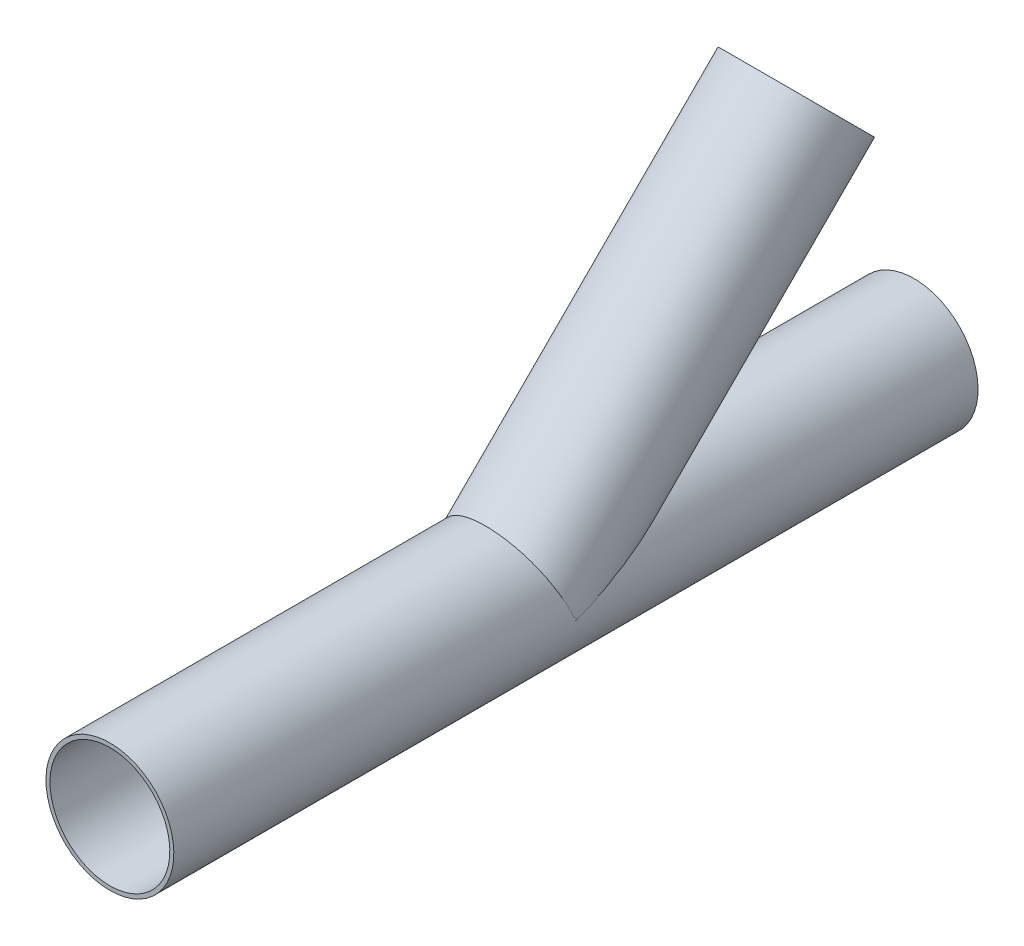
ISO-10303-21;
HEADER;
FILE_DESCRIPTION(('STEP AP214'),'2;1');
FILE_NAME('part.step','',(''),(''),'','','');
FILE_SCHEMA(('AUTOMOTIVE_DESIGN { 1 0 10303 214 1 1 1 1 }'));
ENDSEC;
DATA;
#1=APPLICATION_CONTEXT('core data for automotive mechanical design processes');
#2=APPLICATION_PROTOCOL_DEFINITION('international standard','automotive_design',2000,#1);
#3=PRODUCT_CONTEXT('',#1,'mechanical');
#4=PRODUCT('Part','Part','',(#3));
#5=PRODUCT_RELATED_PRODUCT_CATEGORY('part','',(#4));
#6=PRODUCT_DEFINITION_FORMATION('','',#4);
#7=PRODUCT_DEFINITION_CONTEXT('part definition',#1,'design');
#8=PRODUCT_DEFINITION('design','',#6,#7);
#9=PRODUCT_DEFINITION_SHAPE('','',#8);
#10=(LENGTH_UNIT() NAMED_UNIT(*) SI_UNIT(.MILLI.,.METRE.));
#11=(NAMED_UNIT(*) PLANE_ANGLE_UNIT() SI_UNIT($,.RADIAN.));
#12=(NAMED_UNIT(*) SI_UNIT($,.STERADIAN.) SOLID_ANGLE_UNIT());
#13=UNCERTAINTY_MEASURE_WITH_UNIT(LENGTH_MEASURE(1.E-05),#10,'distance_accuracy_value','');
#14=(GEOMETRIC_REPRESENTATION_CONTEXT(3) GLOBAL_UNCERTAINTY_ASSIGNED_CONTEXT((#13)) GLOBAL_UNIT_ASSIGNED_CONTEXT((#10,
#11,#12)) REPRESENTATION_CONTEXT('',''));
#15=CARTESIAN_POINT('',(0.,0.,0.));
#16=DIRECTION('',(0.,0.,1.));
#17=DIRECTION('',(1.,0.,0.));
#18=AXIS2_PLACEMENT_3D('',#15,#16,#17);
#19=CARTESIAN_POINT('',(0.,353.553390593272,-353.553390593275));
#20=DIRECTION('',(0.,-0.707106781186544,0.707106781186551));
#21=DIRECTION('',(0.,-0.707106781186551,-0.707106781186544));
#22=AXIS2_PLACEMENT_3D('',#19,#20,#21);
#23=CYLINDRICAL_SURFACE('',#22,74.5);
#24=CARTESIAN_POINT('',(0.,353.553390593272,-353.553390593275));
#25=DIRECTION('',(0.,0.707106781186544,-0.707106781186551));
#26=DIRECTION('',(0.,0.707106781186551,0.707106781186544));
#27=AXIS2_PLACEMENT_3D('',#24,#25,#26);
#28=CIRCLE('',#27,74.5);
#29=CARTESIAN_POINT('',(0.,406.23284579167,-300.873935394878));
#30=VERTEX_POINT('',#29);
#31=EDGE_CURVE('E91',#30,#30,#28,.T.);
#32=ORIENTED_EDGE('',*,*,#31,.T.);
#33=EDGE_LOOP('',(#32));
#34=FACE_BOUND('',#33,.T.);
#35=CARTESIAN_POINT('',(0.,79.5000000000003,-184.858910396797));
#36=CARTESIAN_POINT('',(0.916473345615551,79.4999968370298,-184.858902519054));
#37=CARTESIAN_POINT('',(1.83301175927182,79.484108227431,-184.819036929391));
#38=CARTESIAN_POINT('',(3.6581791572464,79.4210421686026,-184.660788213563));
#39=CARTESIAN_POINT('',(4.56680748053886,79.3738621293813,-184.542398587963));
#40=CARTESIAN_POINT('',(6.36982747706487,79.2495599012649,-184.230446552565));
#41=CARTESIAN_POINT('',(7.26420427308407,79.1724083162759,-184.036810340853));
#42=CARTESIAN_POINT('',(9.03191516690699,78.9902816308743,-183.579628636092));
#43=CARTESIAN_POINT('',(9.90524699942825,78.8853035496793,-183.316075653536));
#44=CARTESIAN_POINT('',(11.8384831968399,78.6210636807757,-182.652546361617));
#45=CARTESIAN_POINT('',(12.891403445037,78.4548006270642,-182.234958245629));
#46=CARTESIAN_POINT('',(14.9524725729772,78.088224031074,-181.313953136172));
#47=CARTESIAN_POINT('',(15.9606086282144,77.8879008135206,-180.810511754738));
#48=CARTESIAN_POINT('',(18.9176477354788,77.2427809220914,-179.1885914392));
#49=CARTESIAN_POINT('',(20.7971626709418,76.7541273841853,-177.9592524275));
#50=CARTESIAN_POINT('',(23.3264373706989,76.0047958050352,-176.072137782285));
#51=CARTESIAN_POINT('',(24.0537166969221,75.7775096170781,-175.499518118673));
#52=CARTESIAN_POINT('',(25.4780752621681,75.3105494264291,-174.322541969162));
#53=CARTESIAN_POINT('',(26.1751608001273,75.0708780306045,-173.718192161473));
#54=CARTESIAN_POINT('',(27.5408624989332,74.5806800685627,-172.48152208028));
#55=CARTESIAN_POINT('',(28.2094577870256,74.3301458060782,-171.849181968984));
#56=CARTESIAN_POINT('',(29.5192538413295,73.8197642638601,-170.5603268534));
#57=CARTESIAN_POINT('',(30.1604535247432,73.5599166167647,-169.903810895479));
#58=CARTESIAN_POINT('',(31.4182765279049,73.0315565574644,-168.568145952586));
#59=CARTESIAN_POINT('',(32.0348431033674,72.763026457802,-167.888950660573));
#60=CARTESIAN_POINT('',(33.2433689955826,72.2188862940032,-166.511836679653));
#61=CARTESIAN_POINT('',(33.8353289496613,71.9432764135369,-165.813918476453));
#62=CARTESIAN_POINT('',(34.9959017706084,71.3859309297682,-164.401680440194));
#63=CARTESIAN_POINT('',(35.5645206438356,71.104196931291,-163.687364901372));
#64=CARTESIAN_POINT('',(36.6799029162562,70.5352864921914,-162.243970021145));
#65=CARTESIAN_POINT('',(37.2266654657067,70.2481098406051,-161.514890107379));
#66=CARTESIAN_POINT('',(38.3315391469445,69.651708045372,-159.999679934412));
#67=CARTESIAN_POINT('',(38.8883817689266,69.3421895199246,-159.212740780314));
#68=CARTESIAN_POINT('',(39.9802269241163,68.7184586127194,-157.625660793891));
#69=CARTESIAN_POINT('',(40.5152283544662,68.4042459950277,-156.825519297778));
#70=CARTESIAN_POINT('',(42.0895114226032,67.4553654322435,-154.407145713899));
#71=CARTESIAN_POINT('',(43.0979313774252,66.8145312429495,-152.771158740407));
#72=CARTESIAN_POINT('',(45.0418629998623,65.5198053704473,-149.45947946336));
#73=CARTESIAN_POINT('',(45.9773053044045,64.8659019892219,-147.783751312595));
#74=CARTESIAN_POINT('',(47.7814768723458,63.5486250893652,-144.400679990209));
#75=CARTESIAN_POINT('',(48.6502111205881,62.8852522827503,-142.693339192738));
#76=CARTESIAN_POINT('',(50.3284412809849,61.5503791534484,-139.249284921677));
#77=CARTESIAN_POINT('',(51.1378418399058,60.8788676854565,-137.512529460947));
#78=CARTESIAN_POINT('',(52.7010638634016,59.5307733835317,-134.016148544851));
#79=CARTESIAN_POINT('',(53.454884376471,58.8541904629959,-132.256522698559));
#80=CARTESIAN_POINT('',(54.9109284121713,57.4980790422889,-128.718363426976));
#81=CARTESIAN_POINT('',(55.6131771218546,56.8185521539693,-126.939839723583));
#82=CARTESIAN_POINT('',(56.9701773553412,55.4578402652709,-123.365450356024));
#83=CARTESIAN_POINT('',(57.6249294244348,54.7766552840209,-121.569584891218));
#84=CARTESIAN_POINT('',(58.8168675433299,53.493005947647,-118.17115126365));
#85=CARTESIAN_POINT('',(59.3588896395046,52.8905558005945,-116.570268821047));
#86=CARTESIAN_POINT('',(60.4101338150079,51.686597635299,-113.357441221129));
#87=CARTESIAN_POINT('',(60.9193561199802,51.0850896106025,-111.745496140004));
#88=CARTESIAN_POINT('',(61.9066708230491,49.8840497615943,-108.511254537522));
#89=CARTESIAN_POINT('',(62.384761236652,49.2845180655711,-106.888957363498));
#90=CARTESIAN_POINT('',(63.3111975777639,48.088609324528,-103.634741724007));
#91=CARTESIAN_POINT('',(63.7595434753754,47.4922322826796,-102.002823248871));
#92=CARTESIAN_POINT('',(64.6268202836151,46.305110980375,-98.7332090267022));
#93=CARTESIAN_POINT('',(65.0458100409376,45.7143576294031,-97.0955321761403));
#94=CARTESIAN_POINT('',(65.8564320911169,44.5386368073682,-93.8113544337773));
#95=CARTESIAN_POINT('',(66.2480643329054,43.9536693471075,-92.1648535255106));
#96=CARTESIAN_POINT('',(67.0048171862133,42.7911839115067,-88.8632916448135));
#97=CARTESIAN_POINT('',(67.369939657569,42.2136654159146,-87.2082312816297));
#98=CARTESIAN_POINT('',(68.0744091706656,41.0679554287769,-83.8894287643955));
#99=CARTESIAN_POINT('',(68.4137564230997,40.4997638610205,-82.2256866814306));
#100=CARTESIAN_POINT('',(68.9807000818772,39.5239385298475,-79.3310001988316));
#101=CARTESIAN_POINT('',(69.2140963358435,39.1136240621505,-78.1020916615078));
#102=CARTESIAN_POINT('',(69.6673830883059,38.3004229381638,-75.6393380132235));
#103=CARTESIAN_POINT('',(69.8872736526382,37.8975362456725,-74.4054929263586));
#104=CARTESIAN_POINT('',(70.3136461922664,37.1004775589759,-71.9325807976368));
#105=CARTESIAN_POINT('',(70.5201272250757,36.7063061786063,-70.6935133952342));
#106=CARTESIAN_POINT('',(70.9196699106571,35.9282846594408,-68.2099809527997));
#107=CARTESIAN_POINT('',(71.1127315648244,35.544434519572,-66.965515913329));
#108=CARTESIAN_POINT('',(71.4857302656156,34.7881943538361,-64.4683189295519));
#109=CARTESIAN_POINT('',(71.6656397989549,34.4158292437755,-63.2155753145079));
#110=CARTESIAN_POINT('',(72.0117026027396,33.685721989621,-60.7039171276745));
#111=CARTESIAN_POINT('',(72.1778557510185,33.3279799754047,-59.4450025011873));
#112=CARTESIAN_POINT('',(72.4960292674801,32.6300899907729,-56.9207453256656));
#113=CARTESIAN_POINT('',(72.6480520118065,32.2899390665542,-55.6554038952302));
#114=CARTESIAN_POINT('',(72.9374529535795,31.6307989147984,-53.1175524043385));
#115=CARTESIAN_POINT('',(73.0748315193072,31.3118091551633,-51.8450425250068));
#116=CARTESIAN_POINT('',(73.2982434536206,30.7843366799546,-49.6455301353555));
#117=CARTESIAN_POINT('',(73.3879642619443,30.5697039272105,-48.7203771298108));
#118=CARTESIAN_POINT('',(73.5588868787169,30.1560973427165,-46.8658010703255));
#119=CARTESIAN_POINT('',(73.6400889063562,29.9571231081018,-45.9363781268941));
#120=CARTESIAN_POINT('',(73.793456873759,29.5773171657123,-44.0726278955217));
#121=CARTESIAN_POINT('',(73.8656186920456,29.3964937403951,-43.1382985715272));
#122=CARTESIAN_POINT('',(74.0001385816271,29.056203596079,-41.2650375199981));
#123=CARTESIAN_POINT('',(74.062496756649,28.8967366511219,-40.3261058412669));
#124=CARTESIAN_POINT('',(74.1763465053455,28.6032229000745,-38.4456824806192));
#125=CARTESIAN_POINT('',(74.2278614314953,28.469121530132,-37.5042008163526));
#126=CARTESIAN_POINT('',(74.3189891411705,28.230377453552,-35.6168197156953));
#127=CARTESIAN_POINT('',(74.3586011664932,28.1257366235477,-34.6709200017752));
#128=CARTESIAN_POINT('',(74.4243341776404,27.9513366799721,-32.7761269618144));
#129=CARTESIAN_POINT('',(74.4504659203027,27.8815497555107,-31.8272366324679));
#130=CARTESIAN_POINT('',(74.4872966423951,27.7830070367093,-29.9271285076226));
#131=CARTESIAN_POINT('',(74.497998851082,27.7542426567494,-28.9759112408875));
#132=CARTESIAN_POINT('',(74.5015782476623,27.7446406150244,-27.0271114744445));
#133=CARTESIAN_POINT('',(74.4935701216697,27.7661833001223,-26.0295071677794));
#134=CARTESIAN_POINT('',(74.4543659829971,27.871145270073,-24.0378428932668));
#135=CARTESIAN_POINT('',(74.4231710791346,27.9545615960589,-23.0437827582169));
#136=CARTESIAN_POINT('',(74.3336296663677,28.1918027636036,-21.0681111705734));
#137=CARTESIAN_POINT('',(74.2753651150275,28.345415053077,-20.086471265886));
#138=CARTESIAN_POINT('',(74.1273583851348,28.7302510218022,-18.1407647472693));
#139=CARTESIAN_POINT('',(74.0376187720892,28.961468375462,-17.1766967078069));
#140=CARTESIAN_POINT('',(73.8212729817499,29.5085935235217,-15.2646034821244));
#141=CARTESIAN_POINT('',(73.6942482697006,29.8254593598838,-14.316897391888));
#142=CARTESIAN_POINT('',(73.4004106565465,30.5414298710257,-12.4594778381062));
#143=CARTESIAN_POINT('',(73.2335995360759,30.9405308652762,-11.5497626764235));
#144=CARTESIAN_POINT('',(72.857984692864,31.8149391469404,-9.7750660236767));
#145=CARTESIAN_POINT('',(72.6491132672627,32.2903690446832,-8.91015951817086));
#146=CARTESIAN_POINT('',(72.189034974605,33.3062071889046,-7.23116797891092));
#147=CARTESIAN_POINT('',(71.9378194037947,33.8466287877397,-6.4170934408071));
#148=CARTESIAN_POINT('',(71.499248979596,34.7599757300971,-5.14645730828592));
#149=CARTESIAN_POINT('',(71.3248461967015,35.1167033140529,-4.67354875186478));
#150=CARTESIAN_POINT('',(70.960698416389,35.8468351697499,-3.74682393221434));
#151=CARTESIAN_POINT('',(70.7709524057676,36.2202405420933,-3.29300893285811));
#152=CARTESIAN_POINT('',(70.376428066243,36.9809683681144,-2.40387439836362));
#153=CARTESIAN_POINT('',(70.1716472737935,37.3682930972367,-1.96855791285895));
#154=CARTESIAN_POINT('',(69.7473953368052,38.1542963375782,-1.11562299524608));
#155=CARTESIAN_POINT('',(69.5279224356634,38.5529762031431,-0.698006689171979));
#156=CARTESIAN_POINT('',(69.0740047118865,39.3604744481428,0.121556160477907));
#157=CARTESIAN_POINT('',(68.8395192970403,39.7693183147636,0.523455041021443));
#158=CARTESIAN_POINT('',(68.3564590837657,40.5940036436026,1.3113192822459));
#159=CARTESIAN_POINT('',(68.1078829101441,41.009845786026,1.69728308136089));
#160=CARTESIAN_POINT('',(67.3415306082425,42.2649698782195,2.83266511031254));
#161=CARTESIAN_POINT('',(66.8030476974553,43.1119981457914,3.559722711902));
#162=CARTESIAN_POINT('',(65.7875200898424,44.6421084938305,4.81944406755451));
#163=CARTESIAN_POINT('',(65.3200394760644,45.3237428843097,5.36170702778553));
#164=CARTESIAN_POINT('',(64.3524003655674,46.68744309587,6.41591511201127));
#165=CARTESIAN_POINT('',(63.8522381537562,47.3695089572408,6.92785677656773));
#166=CARTESIAN_POINT('',(62.8200105316443,48.7301341913,7.92421401610138));
#167=CARTESIAN_POINT('',(62.287931874906,49.4086919793242,8.40861799724206));
#168=CARTESIAN_POINT('',(61.1929254514179,50.7585575284821,9.35188897288146));
#169=CARTESIAN_POINT('',(60.6299987334208,51.4298655351615,9.81075683447307));
#170=CARTESIAN_POINT('',(59.4741056475795,52.7622844130763,10.7047843260385));
#171=CARTESIAN_POINT('',(58.8811398168486,53.4233954663624,11.1399443796304));
#172=CARTESIAN_POINT('',(57.6659510838676,54.7328600280936,11.9880383465042));
#173=CARTESIAN_POINT('',(57.0437280107665,55.3812134620076,12.4009721299632));
#174=CARTESIAN_POINT('',(55.7709592003699,56.6627348331486,13.2056978045917));
#175=CARTESIAN_POINT('',(55.1204195530413,57.2959059905995,13.5974942015244));
#176=CARTESIAN_POINT('',(53.7916461752311,58.5452004389071,14.3609956048946));
#177=CARTESIAN_POINT('',(53.1134100610595,59.1613222547283,14.7326988755973));
#178=CARTESIAN_POINT('',(51.708486562453,60.3935639530609,15.4680219210998));
#179=CARTESIAN_POINT('',(50.9809472118806,61.0090807926977,15.8310250373875));
#180=CARTESIAN_POINT('',(49.4982453126327,62.2180747763271,16.5370112834976));
#181=CARTESIAN_POINT('',(48.7430803930067,62.8115500197603,16.8799926883787));
#182=CARTESIAN_POINT('',(47.2062133927548,63.9746204486371,17.5463240893095));
#183=CARTESIAN_POINT('',(46.4245122868504,64.5442165094917,17.8696748052155));
#184=CARTESIAN_POINT('',(44.8355352090527,65.6579483383072,18.4970874075362));
#185=CARTESIAN_POINT('',(44.0282570960736,66.2020819652792,18.8011476726902));
#186=CARTESIAN_POINT('',(42.3895519533981,67.2631280303409,19.3900565968539));
#187=CARTESIAN_POINT('',(41.5581323196378,67.7800486716231,19.6749110526934));
#188=CARTESIAN_POINT('',(39.8720195771351,68.7854314544896,20.2256415984648));
#189=CARTESIAN_POINT('',(39.0173245562155,69.2738912474751,20.4915161225729));
#190=CARTESIAN_POINT('',(37.2859929908761,70.2209248974629,21.0042958396415));
#191=CARTESIAN_POINT('',(36.4093569882046,70.6794994913599,21.2512015003538));
#192=CARTESIAN_POINT('',(34.6354380131287,71.5654902383972,21.7260380147533));
#193=CARTESIAN_POINT('',(33.7381549536369,71.9929062600817,21.9539687883873));
#194=CARTESIAN_POINT('',(31.8822435046319,72.8344579954499,22.400936210381));
#195=CARTESIAN_POINT('',(30.9227003093105,73.2470577692294,22.619069715613));
#196=CARTESIAN_POINT('',(28.9841795349201,74.0355472706379,23.0344066151601));
#197=CARTESIAN_POINT('',(28.0052016729077,74.4114364633362,23.2316097044898));
#198=CARTESIAN_POINT('',(26.0295769913539,75.1253238824211,23.6049616152632));
#199=CARTESIAN_POINT('',(25.032930282189,75.4633223454134,23.7811105681781));
#200=CARTESIAN_POINT('',(23.0236967940188,76.1003955888858,24.1122375246112));
#201=CARTESIAN_POINT('',(22.0111085400295,76.3994667436263,24.2672135561227));
#202=CARTESIAN_POINT('',(19.9720569527015,76.9576779064241,24.5558278419001));
#203=CARTESIAN_POINT('',(18.945594625357,77.2168207929209,24.6894676343264));
#204=CARTESIAN_POINT('',(16.8806907528822,77.6943707846956,24.9352900781361));
#205=CARTESIAN_POINT('',(15.8422492004309,77.9127778650769,25.0474727164055));
#206=CARTESIAN_POINT('',(13.7554620608325,78.3081409905576,25.2502540176454));
#207=CARTESIAN_POINT('',(12.7071169284654,78.4850989295009,25.3408536667626));
#208=CARTESIAN_POINT('',(10.6025599837492,78.7970010127619,25.5003702268571));
#209=CARTESIAN_POINT('',(9.5463482002705,78.9319453111905,25.5692872173689));
#210=CARTESIAN_POINT('',(7.47803682066547,79.154021316159,25.682620644166));
#211=CARTESIAN_POINT('',(6.46620203268953,79.2431052418315,25.7280379692138));
#212=CARTESIAN_POINT('',(4.43915256799174,79.3824703792711,25.7990606306788));
#213=CARTESIAN_POINT('',(3.42393761225822,79.4327483038808,25.8246642887312));
#214=CARTESIAN_POINT('',(0.376271203415832,79.5250688755026,25.8716812609059));
#215=CARTESIAN_POINT('',(-1.65881856311954,79.5086645676542,25.8633343069354));
#216=CARTESIAN_POINT('',(-5.71935795424866,79.3200561062789,25.7672641805015));
#217=CARTESIAN_POINT('',(-7.74480859717624,79.1478687951735,25.6795495888407));
#218=CARTESIAN_POINT('',(-11.7717880101405,78.6497942321114,25.4251686861094));
#219=CARTESIAN_POINT('',(-13.7733168408352,78.3239073699718,25.258502575278));
#220=CARTESIAN_POINT('',(-17.7014232220127,77.5296844129392,24.8507279211034));
#221=CARTESIAN_POINT('',(-19.628702167868,77.0640719095027,24.6110414720691));
#222=CARTESIAN_POINT('',(-23.4334280843229,75.9936065591027,24.0570986259751));
#223=CARTESIAN_POINT('',(-25.3108759012122,75.3887560785293,23.7428434962292));
#224=CARTESIAN_POINT('',(-28.0796630711456,74.3824440275041,23.2163853907583));
#225=CARTESIAN_POINT('',(-28.994654668614,74.0305186527412,23.0317296509952));
#226=CARTESIAN_POINT('',(-30.8076731101512,73.2945694766196,22.6441231101653));
#227=CARTESIAN_POINT('',(-31.7057013909333,72.9105484086951,22.441173866952));
#228=CARTESIAN_POINT('',(-33.4835108524581,72.1114037472576,22.0170397313125));
#229=CARTESIAN_POINT('',(-34.3632902705108,71.6962771669058,21.7958530874746));
#230=CARTESIAN_POINT('',(-36.1031599414515,70.8361029947182,21.335330190455));
#231=CARTESIAN_POINT('',(-36.9632517739134,70.3910578146699,21.0959954000267));
#232=CARTESIAN_POINT('',(-38.6851234617691,69.4600200534294,20.5925863614145));
#233=CARTESIAN_POINT('',(-39.5463426879513,68.9732543610756,20.3280242167983));
#234=CARTESIAN_POINT('',(-41.2454605050343,67.9708383805688,19.7797654762326));
#235=CARTESIAN_POINT('',(-42.0833609720451,67.4551904262523,19.4960704259441));
#236=CARTESIAN_POINT('',(-43.7348138905554,66.3963723710314,18.9093890619314));
#237=CARTESIAN_POINT('',(-44.5483633677977,65.8531989297766,18.606400405685));
#238=CARTESIAN_POINT('',(-46.1498029254604,64.7409917183842,17.9810026163089));
#239=CARTESIAN_POINT('',(-46.9376951782637,64.1719601474639,17.6585951339816));
#240=CARTESIAN_POINT('',(-48.4886688190715,63.0082626057022,16.9932497637376));
#241=CARTESIAN_POINT('',(-49.251686453317,62.4135386548775,16.6502646794984));
#242=CARTESIAN_POINT('',(-50.7498442438377,61.2015650268104,15.9440670659456));
#243=CARTESIAN_POINT('',(-51.4849867279716,60.5843172390228,15.5808562319692));
#244=CARTESIAN_POINT('',(-52.9264950124756,59.3291619065103,14.8335893789002));
#245=CARTESIAN_POINT('',(-53.6328604833039,58.691254125346,14.4495331212123));
#246=CARTESIAN_POINT('',(-55.0158105312389,57.3969291095619,13.659830688054));
#247=CARTESIAN_POINT('',(-55.6923975868402,56.7405134228675,13.2541863156215));
#248=CARTESIAN_POINT('',(-57.0490304820056,55.3771601237577,12.3987691542243));
#249=CARTESIAN_POINT('',(-57.7274583625319,54.669362025962,11.94779956535));
#250=CARTESIAN_POINT('',(-59.0494323638158,53.238736800257,11.0192924758219));
#251=CARTESIAN_POINT('',(-59.6929778592616,52.5159094032493,10.5417544992063));
#252=CARTESIAN_POINT('',(-60.9445433597131,51.0581630010998,9.5578443009375));
#253=CARTESIAN_POINT('',(-61.552540315396,50.3232365382212,9.05145378260287));
#254=CARTESIAN_POINT('',(-62.7314797090407,48.8457221463307,8.0076595857518));
#255=CARTESIAN_POINT('',(-63.30242303518,48.1031344014551,7.47025665118851));
#256=CARTESIAN_POINT('',(-64.4040936299843,46.61774826896,6.36341486444874));
#257=CARTESIAN_POINT('',(-64.9349621283792,45.8749608658675,5.79410214894522));
#258=CARTESIAN_POINT('',(-65.9576438528335,44.3920081729777,4.61788092675571));
#259=CARTESIAN_POINT('',(-66.4494529938858,43.6518431651562,4.01096849950351));
#260=CARTESIAN_POINT('',(-67.3919548929028,42.1821683722084,2.75607327425862));
#261=CARTESIAN_POINT('',(-67.8427014923839,41.4526457190904,2.10814620204357));
#262=CARTESIAN_POINT('',(-68.702125373387,40.0121335205267,0.765799431116827));
#263=CARTESIAN_POINT('',(-69.1108173908909,39.3011375489685,0.0713961594599071));
#264=CARTESIAN_POINT('',(-69.8510765175543,37.9684991532112,-1.30682098482921));
#265=CARTESIAN_POINT('',(-70.1862573003953,37.3444491013077,-1.98634992176881));
#266=CARTESIAN_POINT('',(-70.8187963074916,36.1305456748436,-3.39202442173709));
#267=CARTESIAN_POINT('',(-71.1161604420814,35.5406869644064,-4.11816267347325));
#268=CARTESIAN_POINT('',(-71.6709696371693,34.4081192195302,-5.6170986097684));
#269=CARTESIAN_POINT('',(-71.9285369824298,33.8652680984406,-6.38974279822526));
#270=CARTESIAN_POINT('',(-72.4039969413771,32.8364534027482,-7.98379029263185));
#271=CARTESIAN_POINT('',(-72.6218910798161,32.3504876421385,-8.80519172309491));
#272=CARTESIAN_POINT('',(-73.0199405245405,31.4418075099773,-10.5021178079704));
#273=CARTESIAN_POINT('',(-73.1997006541543,31.0197673144031,-11.3780979625644));
#274=CARTESIAN_POINT('',(-73.5199465272592,30.2529438293069,-13.1700946432535));
#275=CARTESIAN_POINT('',(-73.660434624995,29.9081559089805,-14.0861087656197));
#276=CARTESIAN_POINT('',(-73.9049211621448,29.2988181062441,-15.950134248631));
#277=CARTESIAN_POINT('',(-74.0088800719474,29.0343551882441,-16.8981790627012));
#278=CARTESIAN_POINT('',(-74.1838783169126,28.5842734068198,-18.8158216487133));
#279=CARTESIAN_POINT('',(-74.254910900296,28.3986707148997,-19.7854237984621));
#280=CARTESIAN_POINT('',(-74.3496107919677,28.1495339077157,-21.4157963043766));
#281=CARTESIAN_POINT('',(-74.3811727145342,28.0659290617735,-22.0731807186149));
#282=CARTESIAN_POINT('',(-74.4326613762278,27.9290955675226,-23.391622335512));
#283=CARTESIAN_POINT('',(-74.452586908389,27.8758700702763,-24.0526799119875));
#284=CARTESIAN_POINT('',(-74.4819932663576,27.7972008718206,-25.376861862859));
#285=CARTESIAN_POINT('',(-74.4914703004831,27.7717672561073,-26.0399869000359));
#286=CARTESIAN_POINT('',(-74.5010522535556,27.7460517120727,-27.3668024686305));
#287=CARTESIAN_POINT('',(-74.5011565285463,27.7457715119195,-28.0304930357703));
#288=CARTESIAN_POINT('',(-74.4929311483138,27.7678469717182,-29.3602729202759));
#289=CARTESIAN_POINT('',(-74.4845651608199,27.7903001440077,-30.0263602553094));
#290=CARTESIAN_POINT('',(-74.4601843297273,27.8555586348724,-31.3573725579354));
#291=CARTESIAN_POINT('',(-74.4441694584643,27.898364027057,-32.0222975213152));
#292=CARTESIAN_POINT('',(-74.4052147884476,28.0020904373082,-33.3503065748384));
#293=CARTESIAN_POINT('',(-74.3822770984697,28.0630059387283,-34.0133911635962));
#294=CARTESIAN_POINT('',(-74.3300795010073,28.200970057095,-35.3376008980521));
#295=CARTESIAN_POINT('',(-74.3008196480367,28.2780185349325,-35.9987260605957));
#296=CARTESIAN_POINT('',(-74.2116010759796,28.5116438294412,-37.8297997714835));
#297=CARTESIAN_POINT('',(-74.1454108877837,28.6836161137184,-38.9974930388321));
#298=CARTESIAN_POINT('',(-73.9970013247475,29.0643336696625,-41.3259170471335));
#299=CARTESIAN_POINT('',(-73.9147792324566,29.2730851749264,-42.4866465732844));
#300=CARTESIAN_POINT('',(-73.735856988986,29.7208943774008,-44.8018421100818));
#301=CARTESIAN_POINT('',(-73.6391477362926,29.9599711117676,-45.9563037070477));
#302=CARTESIAN_POINT('',(-73.432462028329,30.4630510013765,-48.2584807538773));
#303=CARTESIAN_POINT('',(-73.3224862980001,30.7270527944277,-49.4061965687705));
#304=CARTESIAN_POINT('',(-73.0898236385314,31.2764591997667,-51.6980954928971));
#305=CARTESIAN_POINT('',(-72.9671070361463,31.5619133273207,-52.8422636610175));
#306=CARTESIAN_POINT('',(-72.7097806181554,32.1502864728775,-55.1247529023442));
#307=CARTESIAN_POINT('',(-72.5751706670758,32.4532056898068,-56.2630739087906));
#308=CARTESIAN_POINT('',(-72.2945254154036,33.0736678606723,-58.5338951829444));
#309=CARTESIAN_POINT('',(-72.1484938288582,33.3912060471604,-59.6663972162371));
#310=CARTESIAN_POINT('',(-71.8452525980172,34.0387649595078,-61.9263098726924));
#311=CARTESIAN_POINT('',(-71.6880430040706,34.368785629139,-63.0537205187639));
#312=CARTESIAN_POINT('',(-71.3617897313192,35.0411946185275,-65.3095524955716));
#313=CARTESIAN_POINT('',(-71.1926894133928,35.3836377585462,-66.437949271359));
#314=CARTESIAN_POINT('',(-70.843472431236,36.0777415204517,-68.6901988662451));
#315=CARTESIAN_POINT('',(-70.6633556366422,36.4294022513867,-69.8140516314046));
#316=CARTESIAN_POINT('',(-70.1065236165386,37.4962460565936,-73.1792501909945));
#317=CARTESIAN_POINT('',(-69.7133398273039,38.2232635973061,-75.414145959116));
#318=CARTESIAN_POINT('',(-68.8832898480901,39.6996100826912,-79.8647132357561));
#319=CARTESIAN_POINT('',(-68.446486547175,40.4489058426246,-82.0804075556018));
#320=CARTESIAN_POINT('',(-67.5276600054319,41.9648761925024,-86.4963766245125));
#321=CARTESIAN_POINT('',(-67.0456375132788,42.7315504945583,-88.6966516282207));
#322=CARTESIAN_POINT('',(-65.9714581372946,44.3745095294237,-93.356468756625));
#323=CARTESIAN_POINT('',(-65.373068329033,45.2524984386794,-95.8139767715205));
#324=CARTESIAN_POINT('',(-64.1138808477535,47.0195449603997,-100.709013797452));
#325=CARTESIAN_POINT('',(-63.4530820570267,47.9086027708543,-103.146542449819));
#326=CARTESIAN_POINT('',(-62.0645749773796,49.6942546351683,-108.002057049346));
#327=CARTESIAN_POINT('',(-61.3368146862449,50.5908540464393,-110.420026194043));
#328=CARTESIAN_POINT('',(-59.8099049943893,52.3871645336246,-115.232132371826));
#329=CARTESIAN_POINT('',(-59.010757027965,53.2868755466727,-117.626269882655));
#330=CARTESIAN_POINT('',(-57.3401314071724,55.0804203002435,-122.372867258195));
#331=CARTESIAN_POINT('',(-56.469130360114,55.974256058221,-124.725493118576));
#332=CARTESIAN_POINT('',(-55.0996892506209,57.3121365540445,-128.231005423405));
#333=CARTESIAN_POINT('',(-54.6326885433366,57.7576449571782,-129.395675457416));
#334=CARTESIAN_POINT('',(-53.676612741595,58.6472314662964,-131.716458939957));
#335=CARTESIAN_POINT('',(-53.1875381298374,59.0913096033298,-132.87257257495));
#336=CARTESIAN_POINT('',(-52.1865664807257,59.9771500235313,-135.174396092547));
#337=CARTESIAN_POINT('',(-51.6746902577086,60.4189140234466,-136.320114359204));
#338=CARTESIAN_POINT('',(-50.6263888534328,61.2999802070586,-138.601189856891));
#339=CARTESIAN_POINT('',(-50.089964394164,61.7392824627318,-139.736547391466));
#340=CARTESIAN_POINT('',(-48.9911590603232,62.6147724571044,-141.995593518818));
#341=CARTESIAN_POINT('',(-48.4287825758441,63.050960708264,-143.119284046098));
#342=CARTESIAN_POINT('',(-47.2763482521036,63.9196182980731,-145.353789883409));
#343=CARTESIAN_POINT('',(-46.6862917721733,64.3520878181134,-146.46460582236));
#344=CARTESIAN_POINT('',(-45.6811860163943,65.0670458035462,-148.298514142545));
#345=CARTESIAN_POINT('',(-45.2744429468316,65.3507901443397,-149.025674781042));
#346=CARTESIAN_POINT('',(-44.4474189139816,65.9160659322692,-150.473089709141));
#347=CARTESIAN_POINT('',(-44.0271382945378,66.1975974353841,-151.193344173553));
#348=CARTESIAN_POINT('',(-42.7450077515157,67.0384964079079,-153.342914787397));
#349=CARTESIAN_POINT('',(-41.8618481136079,67.5941833739893,-154.761076709916));
#350=CARTESIAN_POINT('',(-40.0310045210064,68.6943366613511,-157.564716047396));
#351=CARTESIAN_POINT('',(-39.0831797840439,69.2387749063466,-158.950112695312));
#352=CARTESIAN_POINT('',(-37.1179320976403,70.3118988585368,-161.677288167319));
#353=CARTESIAN_POINT('',(-36.1005112053,70.8405850306636,-163.019068278887));
#354=CARTESIAN_POINT('',(-34.5113641847922,71.6210016123314,-164.997445013293));
#355=CARTESIAN_POINT('',(-33.9683812680786,71.8802537030081,-165.654261697819));
#356=CARTESIAN_POINT('',(-32.8616000071807,72.3929371632486,-166.952429123873));
#357=CARTESIAN_POINT('',(-32.2978028798274,72.6463688716804,-167.593780765901));
#358=CARTESIAN_POINT('',(-31.1480272796104,73.1467264243129,-168.859360874063));
#359=CARTESIAN_POINT('',(-30.5620413011644,73.3936500183071,-169.483583420735));
#360=CARTESIAN_POINT('',(-29.3668508854001,73.879999631907,-170.712474887957));
#361=CARTESIAN_POINT('',(-28.7576461934814,74.119425569246,-171.317143593959));
#362=CARTESIAN_POINT('',(-27.5164089614222,74.5891172901914,-172.502807027504));
#363=CARTESIAN_POINT('',(-26.8844395718104,74.8194051741498,-173.083858966871));
#364=CARTESIAN_POINT('',(-25.5950393535087,75.2702490053839,-174.220927957249));
#365=CARTESIAN_POINT('',(-24.9376102061189,75.4908055932396,-174.776946656166));
#366=CARTESIAN_POINT('',(-23.5966768382037,75.9206305070818,-175.860105176397));
#367=CARTESIAN_POINT('',(-22.9131940817256,76.1299077963644,-176.387267933963));
#368=CARTESIAN_POINT('',(-21.518628242379,76.5357830610576,-177.409291588487));
#369=CARTESIAN_POINT('',(-20.807541051683,76.7323791376963,-177.904147648262));
#370=CARTESIAN_POINT('',(-19.273938383604,77.1327644076405,-178.911642452387));
#371=CARTESIAN_POINT('',(-18.4480007506377,77.3347896201915,-179.419803944339));
#372=CARTESIAN_POINT('',(-16.7612170338832,77.7178175272265,-180.382948420176));
#373=CARTESIAN_POINT('',(-15.900383073756,77.8988274398013,-180.837949663267));
#374=CARTESIAN_POINT('',(-14.145402384278,78.2365329928543,-181.686609989873));
#375=CARTESIAN_POINT('',(-13.2512928999939,78.3932548605953,-182.080335243777));
#376=CARTESIAN_POINT('',(-11.431378869853,78.6792306820227,-182.798626206278));
#377=CARTESIAN_POINT('',(-10.5055799768557,78.8084895053121,-183.123204175736));
#378=CARTESIAN_POINT('',(-8.79514207200033,79.0158141227799,-183.643727343064));
#379=CARTESIAN_POINT('',(-8.01494889438477,79.0989031673272,-183.852301240668));
#380=CARTESIAN_POINT('',(-6.43963375345486,79.2427055163833,-184.21324523053));
#381=CARTESIAN_POINT('',(-5.64451357685878,79.3034214811631,-184.365622004908));
#382=CARTESIAN_POINT('',(-4.04394898188345,79.4011269539119,-184.610815630554));
#383=CARTESIAN_POINT('',(-3.2385085259753,79.4381253053642,-184.703654681399));
#384=CARTESIAN_POINT('',(-1.62206271492304,79.4875643965673,-184.82770848274));
#385=CARTESIAN_POINT('',(-0.811056837532692,79.5000027991531,-184.85891736841));
#386=CARTESIAN_POINT('',(0.,79.5000000000003,-184.858910396797));
#387=B_SPLINE_CURVE_WITH_KNOTS('',3,(#35,#36,#37,#38,#39,#40,#41,#42,#43,#44,#45,#46,#47,#48,
#49,#50,#51,#52,#53,#54,#55,#56,#57,#58,#59,#60,#61,#62,#63,#64,#65,#66,#67,#68,#69,#70,#71,#72,
#73,#74,#75,#76,#77,#78,#79,#80,#81,#82,#83,#84,#85,#86,#87,#88,#89,#90,#91,#92,#93,#94,#95,#96,
#97,#98,#99,#100,#101,#102,#103,#104,#105,#106,#107,#108,#109,#110,#111,#112,#113,#114,#115,
#116,#117,#118,#119,#120,#121,#122,#123,#124,#125,#126,#127,#128,#129,#130,#131,#132,#133,#134,
#135,#136,#137,#138,#139,#140,#141,#142,#143,#144,#145,#146,#147,#148,#149,#150,#151,#152,#153,
#154,#155,#156,#157,#158,#159,#160,#161,#162,#163,#164,#165,#166,#167,#168,#169,#170,#171,#172,
#173,#174,#175,#176,#177,#178,#179,#180,#181,#182,#183,#184,#185,#186,#187,#188,#189,#190,#191,
#192,#193,#194,#195,#196,#197,#198,#199,#200,#201,#202,#203,#204,#205,#206,#207,#208,#209,#210,
#211,#212,#213,#214,#215,#216,#217,#218,#219,#220,#221,#222,#223,#224,#225,#226,#227,#228,#229,
#230,#231,#232,#233,#234,#235,#236,#237,#238,#239,#240,#241,#242,#243,#244,#245,#246,#247,#248,
#249,#250,#251,#252,#253,#254,#255,#256,#257,#258,#259,#260,#261,#262,#263,#264,#265,#266,#267,
#268,#269,#270,#271,#272,#273,#274,#275,#276,#277,#278,#279,#280,#281,#282,#283,#284,#285,#286,
#287,#288,#289,#290,#291,#292,#293,#294,#295,#296,#297,#298,#299,#300,#301,#302,#303,#304,#305,
#306,#307,#308,#309,#310,#311,#312,#313,#314,#315,#316,#317,#318,#319,#320,#321,#322,#323,#324,
#325,#326,#327,#328,#329,#330,#331,#332,#333,#334,#335,#336,#337,#338,#339,#340,#341,#342,#343,
#344,#345,#346,#347,#348,#349,#350,#351,#352,#353,#354,#355,#356,#357,#358,#359,#360,#361,#362,
#363,#364,#365,#366,#367,#368,#369,#370,#371,#372,#373,#374,#375,#376,#377,#378,#379,#380,#381,
#382,#383,#384,#385,#386),.UNSPECIFIED.,.T.,.F.,(4,2,2,2,2,2,2,2,2,2,2,2,2,2,2,2,2,2,2,2,2,2,2,
2,2,2,2,2,2,2,2,2,2,2,2,2,2,2,2,2,2,2,2,2,2,2,2,2,2,2,2,2,2,2,2,2,2,2,2,2,2,2,2,2,2,2,2,2,2,2,2,
2,2,2,2,2,2,2,2,2,2,2,2,2,2,2,2,2,2,2,2,2,2,2,2,2,2,2,2,2,2,2,2,2,2,2,2,2,2,2,2,2,2,2,2,2,2,2,2,
2,2,2,2,2,2,2,2,2,2,2,2,2,2,2,2,2,2,2,2,2,2,2,2,2,2,2,2,2,2,2,2,2,2,2,2,2,2,2,2,2,2,2,2,2,2,2,2,
2,2,2,2,2,2,2,2,4),(0.,2.74854428894821,5.4973161033086,8.24879074773629,11.0005602501087,
14.4296091172925,17.8596336870429,24.7261107595981,27.5851443010907,30.4435784983868,
33.3040720711371,36.1646785990964,39.031533849144,41.8983147996399,44.7643533568421,
47.6305032333848,50.6676191954119,53.7048883255745,59.7801805151552,65.8611784636849,
71.9417215589004,78.0318314870435,84.122045650939,90.209265368782,96.2964151905777,
101.679011213765,107.061570203838,112.444471968429,117.82737914352,123.199167374602,
128.570965632922,133.942386659051,139.313763773109,143.263031605505,147.212280184856,
151.16180603671,155.111331477957,159.068895678853,163.026495021924,166.983427653554,
170.940260750263,173.801969478935,176.663604556988,179.526539557408,182.38944426468,
185.246118746859,188.10297515774,190.95754834769,193.811524015486,196.803255649963,
199.7948442257,202.777433743793,205.759780209901,208.77697555998,211.794035901315,
214.815992077697,217.838570170267,219.690442115138,221.542436450012,223.394734926336,
225.247255262197,227.105015452488,228.962957264847,232.678164111486,235.642843356058,
238.607860199861,241.574116259757,244.540271537277,247.50637379727,250.472493380309,
253.437978170051,256.403718723698,259.462238809476,262.521022009892,265.579692977049,
268.638620669727,271.696620923935,274.754873169006,277.813049976629,280.871239685745,
284.071301901444,287.27141074011,290.471499594852,293.671886297033,296.872042174417,
300.072200007632,303.272211594591,306.4722114434,309.521527049804,312.571100927634,
318.668391150708,324.765022246281,330.861637879493,336.846383987871,342.831028391248,
345.823081826323,348.814880701903,351.806967227491,354.798812844629,357.870035165575,
360.941009672858,364.012357754342,367.083445106762,370.161867551044,373.240032346993,
376.318232382853,379.396175729912,382.632707888935,385.869298047805,389.107964024056,
392.346552340605,395.573135694308,398.800056055766,402.022682449738,405.24417575805,
408.186856433406,411.129076632814,414.062068253513,416.994947127339,419.956875898458,
422.918627072422,425.883573469401,428.849127581213,430.838646083731,432.828370909241,
434.818817553613,436.809400951725,438.808559066666,440.807724412173,442.806281400886,
444.804821157436,448.350309767914,451.896399871425,455.444727211445,458.992860742315,
462.549451506561,466.106082788189,469.661562307296,473.217025812436,476.790752340254,
480.364521165915,487.512344295819,494.650006788835,501.787551127461,509.818837243703,
517.850267222937,525.88798790958,533.925547141422,541.91352338996,545.907998984346,
549.902387272095,553.893201171388,557.883897771869,561.873921755736,565.863749999057,
568.504157250516,571.144497490453,576.42503879838,581.71746773878,587.009740314809,
589.681691921313,592.353487567962,595.026195192038,597.698932131617,600.364752875627,
603.030397874545,605.693892354815,608.357784721719,611.327407884411,614.296008038958,
617.261379894881,620.226225506986,622.659586735864,625.092658532496,627.524822591736,
629.957218088537),.UNSPECIFIED.);
#388=CARTESIAN_POINT('',(0.,79.5000000000003,-184.858910396797));
#389=VERTEX_POINT('',#388);
#390=EDGE_CURVE('E56',#389,#389,#387,.T.);
#391=ORIENTED_EDGE('',*,*,#390,.T.);
#392=EDGE_LOOP('',(#391));
#393=FACE_BOUND('',#392,.T.);
#394=ADVANCED_FACE('F51',(#34,#393),#23,.F.);
#395=CARTESIAN_POINT('',(0.,353.553390593272,-353.553390593275));
#396=DIRECTION('',(0.,-0.707106781186544,0.707106781186551));
#397=DIRECTION('',(0.,-0.707106781186551,-0.707106781186544));
#398=AXIS2_PLACEMENT_3D('',#395,#396,#397);
#399=CYLINDRICAL_SURFACE('',#398,79.5);
#400=CARTESIAN_POINT('',(0.,353.553390593272,-353.553390593275));
#401=DIRECTION('',(0.,0.707106781186544,-0.707106781186551));
#402=DIRECTION('',(0.,0.707106781186551,0.707106781186544));
#403=AXIS2_PLACEMENT_3D('',#400,#401,#402);
#404=CIRCLE('',#403,79.5);
#405=CARTESIAN_POINT('',(0.,409.768379697603,-297.338401488945));
#406=VERTEX_POINT('',#405);
#407=EDGE_CURVE('E72',#406,#406,#404,.T.);
#408=ORIENTED_EDGE('',*,*,#407,.F.);
#409=EDGE_LOOP('',(#408));
#410=FACE_BOUND('',#409,.T.);
#411=CARTESIAN_POINT('',(0.,0.,0.));
#412=DIRECTION('',(0.,-0.923879532511288,-0.382683432365087));
#413=DIRECTION('',(0.,-0.382683432365087,0.923879532511288));
#414=AXIS2_PLACEMENT_3D('',#411,#412,#413);
#415=ELLIPSE('',#414,207.743511415345,79.5);
#416=CARTESIAN_POINT('',(-79.5,0.,0.));
#417=VERTEX_POINT('',#416);
#418=CARTESIAN_POINT('',(79.5,0.,0.));
#419=VERTEX_POINT('',#418);
#420=EDGE_CURVE('E65',#417,#419,#415,.T.);
#421=ORIENTED_EDGE('',*,*,#420,.F.);
#422=CARTESIAN_POINT('',(0.,0.,0.));
#423=DIRECTION('',(0.,-0.382683432365087,0.923879532511288));
#424=DIRECTION('',(0.,-0.923879532511288,-0.382683432365087));
#425=AXIS2_PLACEMENT_3D('',#422,#423,#424);
#426=ELLIPSE('',#425,86.0501799232452,79.5);
#427=EDGE_CURVE('E13',#419,#417,#426,.T.);
#428=ORIENTED_EDGE('',*,*,#427,.F.);
#429=EDGE_LOOP('',(#421,#428));
#430=FACE_BOUND('',#429,.T.);
#431=ADVANCED_FACE('F74',(#410,#430),#399,.T.);
#432=CARTESIAN_POINT('',(0.,353.553390593272,-353.553390593275));
#433=DIRECTION('',(0.,0.707106781186544,-0.707106781186551));
#434=DIRECTION('',(0.,0.707106781186551,0.707106781186544));
#435=AXIS2_PLACEMENT_3D('',#432,#433,#434);
#436=PLANE('',#435);
#437=ORIENTED_EDGE('',*,*,#31,.F.);
#438=EDGE_LOOP('',(#437));
#439=FACE_BOUND('',#438,.T.);
#440=ORIENTED_EDGE('',*,*,#407,.T.);
#441=EDGE_LOOP('',(#440));
#442=FACE_BOUND('',#441,.T.);
#443=ADVANCED_FACE('F76',(#439,#442),#436,.T.);
#444=CARTESIAN_POINT('',(0.,0.,500.));
#445=DIRECTION('',(0.,0.,-1.));
#446=DIRECTION('',(0.,1.,0.));
#447=AXIS2_PLACEMENT_3D('',#444,#445,#446);
#448=CYLINDRICAL_SURFACE('',#447,79.5);
#449=ORIENTED_EDGE('',*,*,#390,.F.);
#450=EDGE_LOOP('',(#449));
#451=FACE_BOUND('',#450,.T.);
#452=ORIENTED_EDGE('',*,*,#420,.T.);
#453=ORIENTED_EDGE('',*,*,#427,.T.);
#454=EDGE_LOOP('',(#452,#453));
#455=FACE_BOUND('',#454,.T.);
#456=ADVANCED_FACE('F53',(#451,#455),#448,.F.);
#457=CLOSED_SHELL('',(#394,#431,#443,#456));
#458=MANIFOLD_SOLID_BREP('B2',#457);
#459=CARTESIAN_POINT('',(0.,0.,500.));
#460=DIRECTION('',(0.,0.,-1.));
#461=DIRECTION('',(0.,1.,0.));
#462=AXIS2_PLACEMENT_3D('',#459,#460,#461);
#463=CYLINDRICAL_SURFACE('',#462,74.5);
#464=CARTESIAN_POINT('',(0.,0.,500.));
#465=DIRECTION('',(0.,0.,1.));
#466=DIRECTION('',(0.,-1.,0.));
#467=AXIS2_PLACEMENT_3D('',#464,#465,#466);
#468=CIRCLE('',#467,74.5);
#469=CARTESIAN_POINT('',(0.,-74.5000000000001,500.));
#470=VERTEX_POINT('',#469);
#471=EDGE_CURVE('E155',#470,#470,#468,.T.);
#472=ORIENTED_EDGE('',*,*,#471,.T.);
#473=EDGE_LOOP('',(#472));
#474=FACE_BOUND('',#473,.T.);
#475=CARTESIAN_POINT('',(0.,2.28449098036588E-13,-500.));
#476=DIRECTION('',(0.,0.,1.));
#477=DIRECTION('',(0.,-1.,0.));
#478=AXIS2_PLACEMENT_3D('',#475,#476,#477);
#479=CIRCLE('',#478,74.5);
#480=CARTESIAN_POINT('',(0.,-74.4999999999998,-500.));
#481=VERTEX_POINT('',#480);
#482=EDGE_CURVE('E161',#481,#481,#479,.T.);
#483=ORIENTED_EDGE('',*,*,#482,.F.);
#484=EDGE_LOOP('',(#483));
#485=FACE_BOUND('',#484,.T.);
#486=ADVANCED_FACE('F148',(#474,#485),#463,.F.);
#487=CARTESIAN_POINT('',(0.,0.,500.));
#488=DIRECTION('',(0.,0.,-1.));
#489=DIRECTION('',(0.,1.,0.));
#490=AXIS2_PLACEMENT_3D('',#487,#488,#489);
#491=CYLINDRICAL_SURFACE('',#490,79.5);
#492=CARTESIAN_POINT('',(0.,0.,500.));
#493=DIRECTION('',(0.,0.,1.));
#494=DIRECTION('',(0.,-1.,0.));
#495=AXIS2_PLACEMENT_3D('',#492,#493,#494);
#496=CIRCLE('',#495,79.5);
#497=CARTESIAN_POINT('',(0.,-79.5000000000001,500.));
#498=VERTEX_POINT('',#497);
#499=EDGE_CURVE('E50',#498,#498,#496,.T.);
#500=ORIENTED_EDGE('',*,*,#499,.F.);
#501=EDGE_LOOP('',(#500));
#502=FACE_BOUND('',#501,.T.);
#503=CARTESIAN_POINT('',(0.,2.28449098036588E-13,-500.));
#504=DIRECTION('',(0.,0.,1.));
#505=DIRECTION('',(0.,-1.,0.));
#506=AXIS2_PLACEMENT_3D('',#503,#504,#505);
#507=CIRCLE('',#506,79.5);
#508=CARTESIAN_POINT('',(0.,-79.4999999999998,-500.));
#509=VERTEX_POINT('',#508);
#510=EDGE_CURVE('E151',#509,#509,#507,.T.);
#511=ORIENTED_EDGE('',*,*,#510,.T.);
#512=EDGE_LOOP('',(#511));
#513=FACE_BOUND('',#512,.T.);
#514=ADVANCED_FACE('F168',(#502,#513),#491,.T.);
#515=CARTESIAN_POINT('',(0.,0.,500.));
#516=DIRECTION('',(0.,0.,1.));
#517=DIRECTION('',(0.,-1.,0.));
#518=AXIS2_PLACEMENT_3D('',#515,#516,#517);
#519=PLANE('',#518);
#520=ORIENTED_EDGE('',*,*,#471,.F.);
#521=EDGE_LOOP('',(#520));
#522=FACE_BOUND('',#521,.T.);
#523=ORIENTED_EDGE('',*,*,#499,.T.);
#524=EDGE_LOOP('',(#523));
#525=FACE_BOUND('',#524,.T.);
#526=ADVANCED_FACE('F172',(#522,#525),#519,.T.);
#527=CARTESIAN_POINT('',(0.,2.28449098036588E-13,-500.));
#528=DIRECTION('',(0.,0.,1.));
#529=DIRECTION('',(0.,-1.,0.));
#530=AXIS2_PLACEMENT_3D('',#527,#528,#529);
#531=PLANE('',#530);
#532=ORIENTED_EDGE('',*,*,#482,.T.);
#533=EDGE_LOOP('',(#532));
#534=FACE_BOUND('',#533,.T.);
#535=ORIENTED_EDGE('',*,*,#510,.F.);
#536=EDGE_LOOP('',(#535));
#537=FACE_BOUND('',#536,.T.);
#538=ADVANCED_FACE('F170',(#534,#537),#531,.F.);
#539=CLOSED_SHELL('',(#486,#514,#526,#538));
#540=MANIFOLD_SOLID_BREP('B7_NOT_SHOWN',#539);
#541=ADVANCED_BREP_SHAPE_REPRESENTATION('',(#18,#458,#540),#14);
#542=SHAPE_DEFINITION_REPRESENTATION(#9,#541);
ENDSEC;
END-ISO-10303-21;
